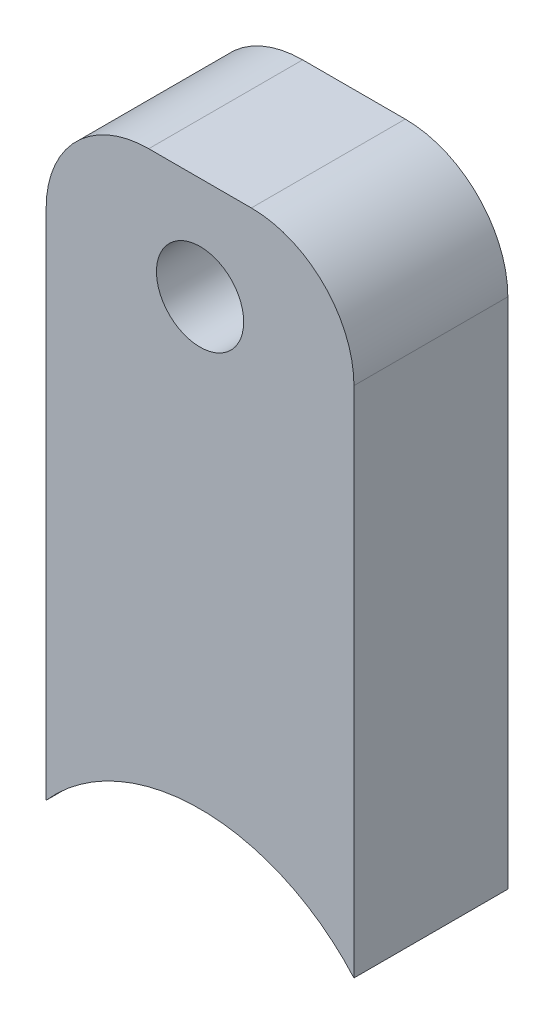
ISO-10303-21;
HEADER;
FILE_DESCRIPTION(('STEP AP214'),'2;1');
FILE_NAME('part.step','',(''),(''),'','','');
FILE_SCHEMA(('AUTOMOTIVE_DESIGN { 1 0 10303 214 1 1 1 1 }'));
ENDSEC;
DATA;
#1=APPLICATION_CONTEXT('core data for automotive mechanical design processes');
#2=APPLICATION_PROTOCOL_DEFINITION('international standard','automotive_design',2000,#1);
#3=PRODUCT_CONTEXT('',#1,'mechanical');
#4=PRODUCT('Part','Part','',(#3));
#5=PRODUCT_RELATED_PRODUCT_CATEGORY('part','',(#4));
#6=PRODUCT_DEFINITION_FORMATION('','',#4);
#7=PRODUCT_DEFINITION_CONTEXT('part definition',#1,'design');
#8=PRODUCT_DEFINITION('design','',#6,#7);
#9=PRODUCT_DEFINITION_SHAPE('','',#8);
#10=(LENGTH_UNIT() NAMED_UNIT(*) SI_UNIT(.MILLI.,.METRE.));
#11=(NAMED_UNIT(*) PLANE_ANGLE_UNIT() SI_UNIT($,.RADIAN.));
#12=(NAMED_UNIT(*) SI_UNIT($,.STERADIAN.) SOLID_ANGLE_UNIT());
#13=UNCERTAINTY_MEASURE_WITH_UNIT(LENGTH_MEASURE(1.E-05),#10,'distance_accuracy_value','');
#14=(GEOMETRIC_REPRESENTATION_CONTEXT(3) GLOBAL_UNCERTAINTY_ASSIGNED_CONTEXT((#13)) GLOBAL_UNIT_ASSIGNED_CONTEXT((#10,
#11,#12)) REPRESENTATION_CONTEXT('',''));
#15=CARTESIAN_POINT('',(0.,0.,0.));
#16=DIRECTION('',(0.,0.,1.));
#17=DIRECTION('',(1.,0.,0.));
#18=AXIS2_PLACEMENT_3D('',#15,#16,#17);
#19=CARTESIAN_POINT('',(15.,-13.228756555323,15.));
#20=DIRECTION('',(0.,0.,-1.));
#21=DIRECTION('',(-1.,0.,0.));
#22=AXIS2_PLACEMENT_3D('',#19,#20,#21);
#23=CYLINDRICAL_SURFACE('',#22,20.);
#24=CARTESIAN_POINT('',(15.,-13.228756555323,0.));
#25=DIRECTION('',(0.,0.,-1.));
#26=DIRECTION('',(-1.,0.,0.));
#27=AXIS2_PLACEMENT_3D('',#24,#25,#26);
#28=CIRCLE('',#27,20.);
#29=CARTESIAN_POINT('',(0.,0.,0.));
#30=VERTEX_POINT('',#29);
#31=CARTESIAN_POINT('',(30.,0.,0.));
#32=VERTEX_POINT('',#31);
#33=EDGE_CURVE('E109',#30,#32,#28,.T.);
#34=ORIENTED_EDGE('',*,*,#33,.T.);
#35=DIRECTION('',(0.,0.,-1.));
#36=VECTOR('',#35,1.);
#37=CARTESIAN_POINT('',(30.,0.,15.));
#38=LINE('',#37,#36);
#39=CARTESIAN_POINT('',(30.,0.,15.));
#40=VERTEX_POINT('',#39);
#41=EDGE_CURVE('E92',#40,#32,#38,.T.);
#42=ORIENTED_EDGE('',*,*,#41,.F.);
#43=CARTESIAN_POINT('',(15.,-13.228756555323,15.));
#44=DIRECTION('',(0.,0.,-1.));
#45=DIRECTION('',(-1.,0.,0.));
#46=AXIS2_PLACEMENT_3D('',#43,#44,#45);
#47=CIRCLE('',#46,20.);
#48=CARTESIAN_POINT('',(0.,0.,15.));
#49=VERTEX_POINT('',#48);
#50=EDGE_CURVE('E97',#49,#40,#47,.T.);
#51=ORIENTED_EDGE('',*,*,#50,.F.);
#52=DIRECTION('',(0.,0.,-1.));
#53=VECTOR('',#52,1.);
#54=CARTESIAN_POINT('',(0.,0.,15.));
#55=LINE('',#54,#53);
#56=EDGE_CURVE('E111',#49,#30,#55,.T.);
#57=ORIENTED_EDGE('',*,*,#56,.T.);
#58=EDGE_LOOP('',(#34,#42,#51,#57));
#59=FACE_BOUND('',#58,.T.);
#60=ADVANCED_FACE('F36',(#59),#23,.F.);
#61=CARTESIAN_POINT('',(30.,60.,15.));
#62=DIRECTION('',(-1.,0.,0.));
#63=DIRECTION('',(0.,-1.,0.));
#64=AXIS2_PLACEMENT_3D('',#61,#62,#63);
#65=PLANE('',#64);
#66=DIRECTION('',(0.,1.,0.));
#67=VECTOR('',#66,1.);
#68=CARTESIAN_POINT('',(30.,60.,0.));
#69=LINE('',#68,#67);
#70=CARTESIAN_POINT('',(30.,50.,0.));
#71=VERTEX_POINT('',#70);
#72=EDGE_CURVE('E141',#32,#71,#69,.T.);
#73=ORIENTED_EDGE('',*,*,#72,.T.);
#74=DIRECTION('',(0.,0.,-1.));
#75=VECTOR('',#74,1.);
#76=CARTESIAN_POINT('',(30.,50.,15.));
#77=LINE('',#76,#75);
#78=CARTESIAN_POINT('',(30.,50.,15.));
#79=VERTEX_POINT('',#78);
#80=EDGE_CURVE('E11',#71,#79,#77,.F.);
#81=ORIENTED_EDGE('',*,*,#80,.T.);
#82=DIRECTION('',(0.,1.,0.));
#83=VECTOR('',#82,1.);
#84=CARTESIAN_POINT('',(30.,60.,15.));
#85=LINE('',#84,#83);
#86=EDGE_CURVE('E88',#40,#79,#85,.T.);
#87=ORIENTED_EDGE('',*,*,#86,.F.);
#88=ORIENTED_EDGE('',*,*,#41,.T.);
#89=EDGE_LOOP('',(#73,#81,#87,#88));
#90=FACE_BOUND('',#89,.T.);
#91=ADVANCED_FACE('F90',(#90),#65,.F.);
#92=CARTESIAN_POINT('',(0.,60.,15.));
#93=DIRECTION('',(0.,-1.,0.));
#94=DIRECTION('',(0.,0.,-1.));
#95=AXIS2_PLACEMENT_3D('',#92,#93,#94);
#96=PLANE('',#95);
#97=DIRECTION('',(-1.,0.,0.));
#98=VECTOR('',#97,1.);
#99=CARTESIAN_POINT('',(0.,60.,0.));
#100=LINE('',#99,#98);
#101=CARTESIAN_POINT('',(20.,60.,0.));
#102=VERTEX_POINT('',#101);
#103=CARTESIAN_POINT('',(10.,60.,0.));
#104=VERTEX_POINT('',#103);
#105=EDGE_CURVE('E138',#102,#104,#100,.T.);
#106=ORIENTED_EDGE('',*,*,#105,.T.);
#107=DIRECTION('',(0.,0.,-1.));
#108=VECTOR('',#107,1.);
#109=CARTESIAN_POINT('',(10.,60.,15.));
#110=LINE('',#109,#108);
#111=CARTESIAN_POINT('',(10.,60.,15.));
#112=VERTEX_POINT('',#111);
#113=EDGE_CURVE('E57',#104,#112,#110,.F.);
#114=ORIENTED_EDGE('',*,*,#113,.T.);
#115=DIRECTION('',(-1.,0.,0.));
#116=VECTOR('',#115,1.);
#117=CARTESIAN_POINT('',(0.,60.,15.));
#118=LINE('',#117,#116);
#119=CARTESIAN_POINT('',(20.,60.,15.));
#120=VERTEX_POINT('',#119);
#121=EDGE_CURVE('E96',#120,#112,#118,.T.);
#122=ORIENTED_EDGE('',*,*,#121,.F.);
#123=DIRECTION('',(0.,0.,-1.));
#124=VECTOR('',#123,1.);
#125=CARTESIAN_POINT('',(20.,60.,15.));
#126=LINE('',#125,#124);
#127=EDGE_CURVE('E122',#120,#102,#126,.T.);
#128=ORIENTED_EDGE('',*,*,#127,.T.);
#129=EDGE_LOOP('',(#106,#114,#122,#128));
#130=FACE_BOUND('',#129,.T.);
#131=ADVANCED_FACE('F139',(#130),#96,.F.);
#132=CARTESIAN_POINT('',(0.,0.,15.));
#133=DIRECTION('',(1.,0.,0.));
#134=DIRECTION('',(0.,0.,-1.));
#135=AXIS2_PLACEMENT_3D('',#132,#133,#134);
#136=PLANE('',#135);
#137=DIRECTION('',(0.,-1.,0.));
#138=VECTOR('',#137,1.);
#139=CARTESIAN_POINT('',(0.,0.,15.));
#140=LINE('',#139,#138);
#141=CARTESIAN_POINT('',(0.,50.,15.));
#142=VERTEX_POINT('',#141);
#143=EDGE_CURVE('E102',#142,#49,#140,.T.);
#144=ORIENTED_EDGE('',*,*,#143,.F.);
#145=DIRECTION('',(0.,0.,-1.));
#146=VECTOR('',#145,1.);
#147=CARTESIAN_POINT('',(0.,50.,15.));
#148=LINE('',#147,#146);
#149=CARTESIAN_POINT('',(0.,50.,0.));
#150=VERTEX_POINT('',#149);
#151=EDGE_CURVE('E110',#142,#150,#148,.T.);
#152=ORIENTED_EDGE('',*,*,#151,.T.);
#153=DIRECTION('',(0.,-1.,0.));
#154=VECTOR('',#153,1.);
#155=CARTESIAN_POINT('',(0.,0.,0.));
#156=LINE('',#155,#154);
#157=EDGE_CURVE('E106',#150,#30,#156,.T.);
#158=ORIENTED_EDGE('',*,*,#157,.T.);
#159=ORIENTED_EDGE('',*,*,#56,.F.);
#160=EDGE_LOOP('',(#144,#152,#158,#159));
#161=FACE_BOUND('',#160,.T.);
#162=ADVANCED_FACE('F131',(#161),#136,.F.);
#163=CARTESIAN_POINT('',(15.,-13.228756555323,15.));
#164=DIRECTION('',(0.,0.,-1.));
#165=DIRECTION('',(-1.,0.,0.));
#166=AXIS2_PLACEMENT_3D('',#163,#164,#165);
#167=PLANE('',#166);
#168=CARTESIAN_POINT('',(15.,50.,15.));
#169=DIRECTION('',(0.,0.,1.));
#170=DIRECTION('',(1.,0.,0.));
#171=AXIS2_PLACEMENT_3D('',#168,#169,#170);
#172=CIRCLE('',#171,4.24999999999999);
#173=CARTESIAN_POINT('',(19.25,50.,15.));
#174=VERTEX_POINT('',#173);
#175=EDGE_CURVE('E150',#174,#174,#172,.T.);
#176=ORIENTED_EDGE('',*,*,#175,.F.);
#177=EDGE_LOOP('',(#176));
#178=FACE_BOUND('',#177,.T.);
#179=ORIENTED_EDGE('',*,*,#121,.T.);
#180=CARTESIAN_POINT('',(10.,50.,15.));
#181=DIRECTION('',(0.,0.,-1.));
#182=DIRECTION('',(-1.,0.,0.));
#183=AXIS2_PLACEMENT_3D('',#180,#181,#182);
#184=CIRCLE('',#183,10.);
#185=EDGE_CURVE('E44',#112,#142,#184,.F.);
#186=ORIENTED_EDGE('',*,*,#185,.T.);
#187=ORIENTED_EDGE('',*,*,#143,.T.);
#188=ORIENTED_EDGE('',*,*,#50,.T.);
#189=ORIENTED_EDGE('',*,*,#86,.T.);
#190=CARTESIAN_POINT('',(20.,50.,15.));
#191=DIRECTION('',(0.,0.,-1.));
#192=DIRECTION('',(-1.,0.,0.));
#193=AXIS2_PLACEMENT_3D('',#190,#191,#192);
#194=CIRCLE('',#193,10.);
#195=EDGE_CURVE('E126',#79,#120,#194,.F.);
#196=ORIENTED_EDGE('',*,*,#195,.T.);
#197=EDGE_LOOP('',(#179,#186,#187,#188,#189,#196));
#198=FACE_BOUND('',#197,.T.);
#199=ADVANCED_FACE('F100',(#178,#198),#167,.F.);
#200=CARTESIAN_POINT('',(15.,-13.228756555323,0.));
#201=DIRECTION('',(0.,0.,-1.));
#202=DIRECTION('',(-1.,0.,0.));
#203=AXIS2_PLACEMENT_3D('',#200,#201,#202);
#204=PLANE('',#203);
#205=CARTESIAN_POINT('',(15.,50.,0.));
#206=DIRECTION('',(0.,0.,1.));
#207=DIRECTION('',(1.,0.,0.));
#208=AXIS2_PLACEMENT_3D('',#205,#206,#207);
#209=CIRCLE('',#208,4.25);
#210=CARTESIAN_POINT('',(19.25,50.,0.));
#211=VERTEX_POINT('',#210);
#212=EDGE_CURVE('E145',#211,#211,#209,.T.);
#213=ORIENTED_EDGE('',*,*,#212,.T.);
#214=EDGE_LOOP('',(#213));
#215=FACE_BOUND('',#214,.T.);
#216=ORIENTED_EDGE('',*,*,#157,.F.);
#217=CARTESIAN_POINT('',(10.,50.,0.));
#218=DIRECTION('',(0.,0.,-1.));
#219=DIRECTION('',(-1.,0.,0.));
#220=AXIS2_PLACEMENT_3D('',#217,#218,#219);
#221=CIRCLE('',#220,10.);
#222=EDGE_CURVE('E120',#150,#104,#221,.T.);
#223=ORIENTED_EDGE('',*,*,#222,.T.);
#224=ORIENTED_EDGE('',*,*,#105,.F.);
#225=CARTESIAN_POINT('',(20.,50.,0.));
#226=DIRECTION('',(0.,0.,-1.));
#227=DIRECTION('',(-1.,0.,0.));
#228=AXIS2_PLACEMENT_3D('',#225,#226,#227);
#229=CIRCLE('',#228,10.);
#230=EDGE_CURVE('E114',#102,#71,#229,.T.);
#231=ORIENTED_EDGE('',*,*,#230,.T.);
#232=ORIENTED_EDGE('',*,*,#72,.F.);
#233=ORIENTED_EDGE('',*,*,#33,.F.);
#234=EDGE_LOOP('',(#216,#223,#224,#231,#232,#233));
#235=FACE_BOUND('',#234,.T.);
#236=ADVANCED_FACE('F137',(#215,#235),#204,.T.);
#237=CARTESIAN_POINT('',(15.,50.,15.));
#238=DIRECTION('',(0.,0.,1.));
#239=DIRECTION('',(1.,0.,0.));
#240=AXIS2_PLACEMENT_3D('',#237,#238,#239);
#241=CYLINDRICAL_SURFACE('',#240,4.24999999999999);
#242=ORIENTED_EDGE('',*,*,#212,.F.);
#243=EDGE_LOOP('',(#242));
#244=FACE_BOUND('',#243,.T.);
#245=ORIENTED_EDGE('',*,*,#175,.T.);
#246=EDGE_LOOP('',(#245));
#247=FACE_BOUND('',#246,.T.);
#248=ADVANCED_FACE('F154',(#244,#247),#241,.F.);
#249=CARTESIAN_POINT('',(10.,50.,15.));
#250=DIRECTION('',(0.,0.,-1.));
#251=DIRECTION('',(-1.,0.,0.));
#252=AXIS2_PLACEMENT_3D('',#249,#250,#251);
#253=CYLINDRICAL_SURFACE('',#252,10.);
#254=ORIENTED_EDGE('',*,*,#185,.F.);
#255=ORIENTED_EDGE('',*,*,#113,.F.);
#256=ORIENTED_EDGE('',*,*,#222,.F.);
#257=ORIENTED_EDGE('',*,*,#151,.F.);
#258=EDGE_LOOP('',(#254,#255,#256,#257));
#259=FACE_BOUND('',#258,.T.);
#260=ADVANCED_FACE('F134',(#259),#253,.T.);
#261=CARTESIAN_POINT('',(20.,50.,15.));
#262=DIRECTION('',(0.,0.,-1.));
#263=DIRECTION('',(-1.,0.,0.));
#264=AXIS2_PLACEMENT_3D('',#261,#262,#263);
#265=CYLINDRICAL_SURFACE('',#264,10.);
#266=ORIENTED_EDGE('',*,*,#195,.F.);
#267=ORIENTED_EDGE('',*,*,#80,.F.);
#268=ORIENTED_EDGE('',*,*,#230,.F.);
#269=ORIENTED_EDGE('',*,*,#127,.F.);
#270=EDGE_LOOP('',(#266,#267,#268,#269));
#271=FACE_BOUND('',#270,.T.);
#272=ADVANCED_FACE('F38',(#271),#265,.T.);
#273=CLOSED_SHELL('',(#60,#91,#131,#162,#199,#236,#248,#260,#272));
#274=MANIFOLD_SOLID_BREP('B2',#273);
#275=ADVANCED_BREP_SHAPE_REPRESENTATION('',(#18,#274),#14);
#276=SHAPE_DEFINITION_REPRESENTATION(#9,#275);
ENDSEC;
END-ISO-10303-21;
